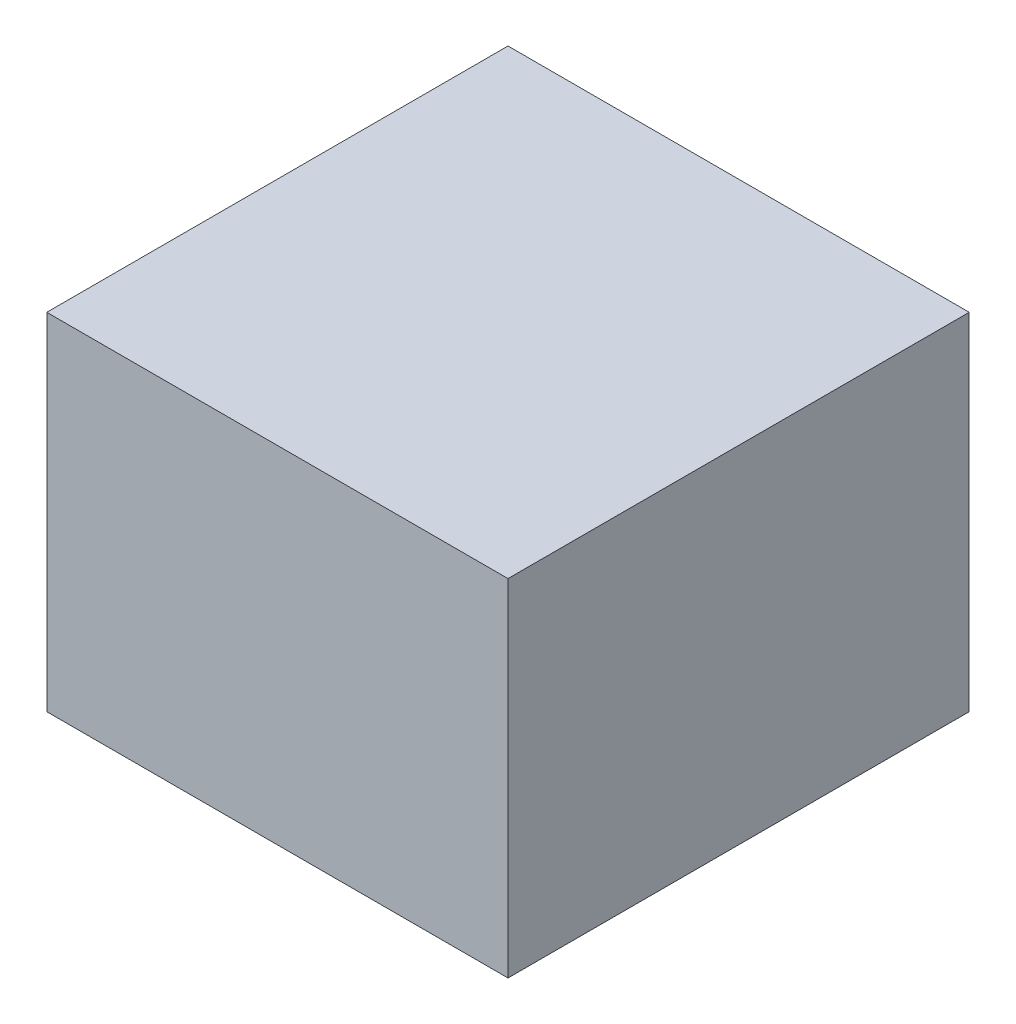
ISO-10303-21;
HEADER;
FILE_DESCRIPTION(('STEP AP214'),'2;1');
FILE_NAME('part.step','',(''),(''),'','','');
FILE_SCHEMA(('AUTOMOTIVE_DESIGN { 1 0 10303 214 1 1 1 1 }'));
ENDSEC;
DATA;
#1=APPLICATION_CONTEXT('core data for automotive mechanical design processes');
#2=APPLICATION_PROTOCOL_DEFINITION('international standard','automotive_design',2000,#1);
#3=PRODUCT_CONTEXT('',#1,'mechanical');
#4=PRODUCT('Part','Part','',(#3));
#5=PRODUCT_RELATED_PRODUCT_CATEGORY('part','',(#4));
#6=PRODUCT_DEFINITION_FORMATION('','',#4);
#7=PRODUCT_DEFINITION_CONTEXT('part definition',#1,'design');
#8=PRODUCT_DEFINITION('design','',#6,#7);
#9=PRODUCT_DEFINITION_SHAPE('','',#8);
#10=(LENGTH_UNIT() NAMED_UNIT(*) SI_UNIT(.MILLI.,.METRE.));
#11=(NAMED_UNIT(*) PLANE_ANGLE_UNIT() SI_UNIT($,.RADIAN.));
#12=(NAMED_UNIT(*) SI_UNIT($,.STERADIAN.) SOLID_ANGLE_UNIT());
#13=UNCERTAINTY_MEASURE_WITH_UNIT(LENGTH_MEASURE(1.E-05),#10,'distance_accuracy_value','');
#14=(GEOMETRIC_REPRESENTATION_CONTEXT(3) GLOBAL_UNCERTAINTY_ASSIGNED_CONTEXT((#13)) GLOBAL_UNIT_ASSIGNED_CONTEXT((#10,
#11,#12)) REPRESENTATION_CONTEXT('',''));
#15=CARTESIAN_POINT('',(0.,0.,0.));
#16=DIRECTION('',(0.,0.,1.));
#17=DIRECTION('',(1.,0.,0.));
#18=AXIS2_PLACEMENT_3D('',#15,#16,#17);
#19=CARTESIAN_POINT('',(-12.7,19.05,12.7));
#20=DIRECTION('',(1.,0.,0.));
#21=DIRECTION('',(0.,0.,-1.));
#22=AXIS2_PLACEMENT_3D('',#19,#20,#21);
#23=PLANE('',#22);
#24=DIRECTION('',(0.,0.,1.));
#25=VECTOR('',#24,1.);
#26=CARTESIAN_POINT('',(-12.7,0.,12.7));
#27=LINE('',#26,#25);
#28=CARTESIAN_POINT('',(-12.7,0.,-12.7));
#29=VERTEX_POINT('',#28);
#30=CARTESIAN_POINT('',(-12.7,0.,12.7));
#31=VERTEX_POINT('',#30);
#32=EDGE_CURVE('E95',#29,#31,#27,.T.);
#33=ORIENTED_EDGE('',*,*,#32,.T.);
#34=DIRECTION('',(0.,-1.,0.));
#35=VECTOR('',#34,1.);
#36=CARTESIAN_POINT('',(-12.7,19.05,12.7));
#37=LINE('',#36,#35);
#38=CARTESIAN_POINT('',(-12.7,19.05,12.7));
#39=VERTEX_POINT('',#38);
#40=EDGE_CURVE('E11',#39,#31,#37,.T.);
#41=ORIENTED_EDGE('',*,*,#40,.F.);
#42=DIRECTION('',(0.,0.,1.));
#43=VECTOR('',#42,1.);
#44=CARTESIAN_POINT('',(-12.7,19.05,12.7));
#45=LINE('',#44,#43);
#46=CARTESIAN_POINT('',(-12.7,19.05,-12.7));
#47=VERTEX_POINT('',#46);
#48=EDGE_CURVE('E83',#47,#39,#45,.T.);
#49=ORIENTED_EDGE('',*,*,#48,.F.);
#50=DIRECTION('',(0.,-1.,0.));
#51=VECTOR('',#50,1.);
#52=CARTESIAN_POINT('',(-12.7,19.05,-12.7));
#53=LINE('',#52,#51);
#54=EDGE_CURVE('E91',#47,#29,#53,.T.);
#55=ORIENTED_EDGE('',*,*,#54,.T.);
#56=EDGE_LOOP('',(#33,#41,#49,#55));
#57=FACE_BOUND('',#56,.T.);
#58=ADVANCED_FACE('F32',(#57),#23,.F.);
#59=CARTESIAN_POINT('',(12.7,19.05,12.7));
#60=DIRECTION('',(0.,0.,-1.));
#61=DIRECTION('',(-1.,0.,0.));
#62=AXIS2_PLACEMENT_3D('',#59,#60,#61);
#63=PLANE('',#62);
#64=DIRECTION('',(1.,0.,0.));
#65=VECTOR('',#64,1.);
#66=CARTESIAN_POINT('',(12.7,0.,12.7));
#67=LINE('',#66,#65);
#68=CARTESIAN_POINT('',(12.7,0.,12.7));
#69=VERTEX_POINT('',#68);
#70=EDGE_CURVE('E87',#31,#69,#67,.T.);
#71=ORIENTED_EDGE('',*,*,#70,.T.);
#72=DIRECTION('',(0.,-1.,0.));
#73=VECTOR('',#72,1.);
#74=CARTESIAN_POINT('',(12.7,19.05,12.7));
#75=LINE('',#74,#73);
#76=CARTESIAN_POINT('',(12.7,19.05,12.7));
#77=VERTEX_POINT('',#76);
#78=EDGE_CURVE('E40',#77,#69,#75,.T.);
#79=ORIENTED_EDGE('',*,*,#78,.F.);
#80=DIRECTION('',(1.,0.,0.));
#81=VECTOR('',#80,1.);
#82=CARTESIAN_POINT('',(12.7,19.05,12.7));
#83=LINE('',#82,#81);
#84=EDGE_CURVE('E78',#39,#77,#83,.T.);
#85=ORIENTED_EDGE('',*,*,#84,.F.);
#86=ORIENTED_EDGE('',*,*,#40,.T.);
#87=EDGE_LOOP('',(#71,#79,#85,#86));
#88=FACE_BOUND('',#87,.T.);
#89=ADVANCED_FACE('F86',(#88),#63,.F.);
#90=CARTESIAN_POINT('',(12.7,19.05,12.7));
#91=DIRECTION('',(-1.,0.,0.));
#92=DIRECTION('',(0.,0.,1.));
#93=AXIS2_PLACEMENT_3D('',#90,#91,#92);
#94=PLANE('',#93);
#95=DIRECTION('',(0.,0.,-1.));
#96=VECTOR('',#95,1.);
#97=CARTESIAN_POINT('',(12.7,0.,12.7));
#98=LINE('',#97,#96);
#99=CARTESIAN_POINT('',(12.7,0.,-12.7));
#100=VERTEX_POINT('',#99);
#101=EDGE_CURVE('E65',#69,#100,#98,.T.);
#102=ORIENTED_EDGE('',*,*,#101,.T.);
#103=DIRECTION('',(0.,-1.,0.));
#104=VECTOR('',#103,1.);
#105=CARTESIAN_POINT('',(12.7,19.05,-12.7));
#106=LINE('',#105,#104);
#107=CARTESIAN_POINT('',(12.7,19.05,-12.7));
#108=VERTEX_POINT('',#107);
#109=EDGE_CURVE('E88',#108,#100,#106,.T.);
#110=ORIENTED_EDGE('',*,*,#109,.F.);
#111=DIRECTION('',(0.,0.,-1.));
#112=VECTOR('',#111,1.);
#113=CARTESIAN_POINT('',(12.7,19.05,12.7));
#114=LINE('',#113,#112);
#115=EDGE_CURVE('E81',#77,#108,#114,.T.);
#116=ORIENTED_EDGE('',*,*,#115,.F.);
#117=ORIENTED_EDGE('',*,*,#78,.T.);
#118=EDGE_LOOP('',(#102,#110,#116,#117));
#119=FACE_BOUND('',#118,.T.);
#120=ADVANCED_FACE('F89',(#119),#94,.F.);
#121=CARTESIAN_POINT('',(12.7,19.05,-12.7));
#122=DIRECTION('',(0.,0.,1.));
#123=DIRECTION('',(1.,0.,0.));
#124=AXIS2_PLACEMENT_3D('',#121,#122,#123);
#125=PLANE('',#124);
#126=DIRECTION('',(-1.,0.,0.));
#127=VECTOR('',#126,1.);
#128=CARTESIAN_POINT('',(12.7,0.,-12.7));
#129=LINE('',#128,#127);
#130=EDGE_CURVE('E71',#100,#29,#129,.T.);
#131=ORIENTED_EDGE('',*,*,#130,.T.);
#132=ORIENTED_EDGE('',*,*,#54,.F.);
#133=DIRECTION('',(-1.,0.,0.));
#134=VECTOR('',#133,1.);
#135=CARTESIAN_POINT('',(12.7,19.05,-12.7));
#136=LINE('',#135,#134);
#137=EDGE_CURVE('E48',#108,#47,#136,.T.);
#138=ORIENTED_EDGE('',*,*,#137,.F.);
#139=ORIENTED_EDGE('',*,*,#109,.T.);
#140=EDGE_LOOP('',(#131,#132,#138,#139));
#141=FACE_BOUND('',#140,.T.);
#142=ADVANCED_FACE('F102',(#141),#125,.F.);
#143=CARTESIAN_POINT('',(0.,19.05,0.));
#144=DIRECTION('',(0.,1.,0.));
#145=DIRECTION('',(0.,0.,1.));
#146=AXIS2_PLACEMENT_3D('',#143,#144,#145);
#147=PLANE('',#146);
#148=ORIENTED_EDGE('',*,*,#48,.T.);
#149=ORIENTED_EDGE('',*,*,#84,.T.);
#150=ORIENTED_EDGE('',*,*,#115,.T.);
#151=ORIENTED_EDGE('',*,*,#137,.T.);
#152=EDGE_LOOP('',(#148,#149,#150,#151));
#153=FACE_BOUND('',#152,.T.);
#154=ADVANCED_FACE('F79',(#153),#147,.T.);
#155=CARTESIAN_POINT('',(0.,0.,0.));
#156=DIRECTION('',(0.,1.,0.));
#157=DIRECTION('',(0.,0.,1.));
#158=AXIS2_PLACEMENT_3D('',#155,#156,#157);
#159=PLANE('',#158);
#160=ORIENTED_EDGE('',*,*,#32,.F.);
#161=ORIENTED_EDGE('',*,*,#130,.F.);
#162=ORIENTED_EDGE('',*,*,#101,.F.);
#163=ORIENTED_EDGE('',*,*,#70,.F.);
#164=EDGE_LOOP('',(#160,#161,#162,#163));
#165=FACE_BOUND('',#164,.T.);
#166=ADVANCED_FACE('F105',(#165),#159,.F.);
#167=CLOSED_SHELL('',(#58,#89,#120,#142,#154,#166));
#168=MANIFOLD_SOLID_BREP('B2',#167);
#169=ADVANCED_BREP_SHAPE_REPRESENTATION('',(#18,#168),#14);
#170=SHAPE_DEFINITION_REPRESENTATION(#9,#169);
ENDSEC;
END-ISO-10303-21;
